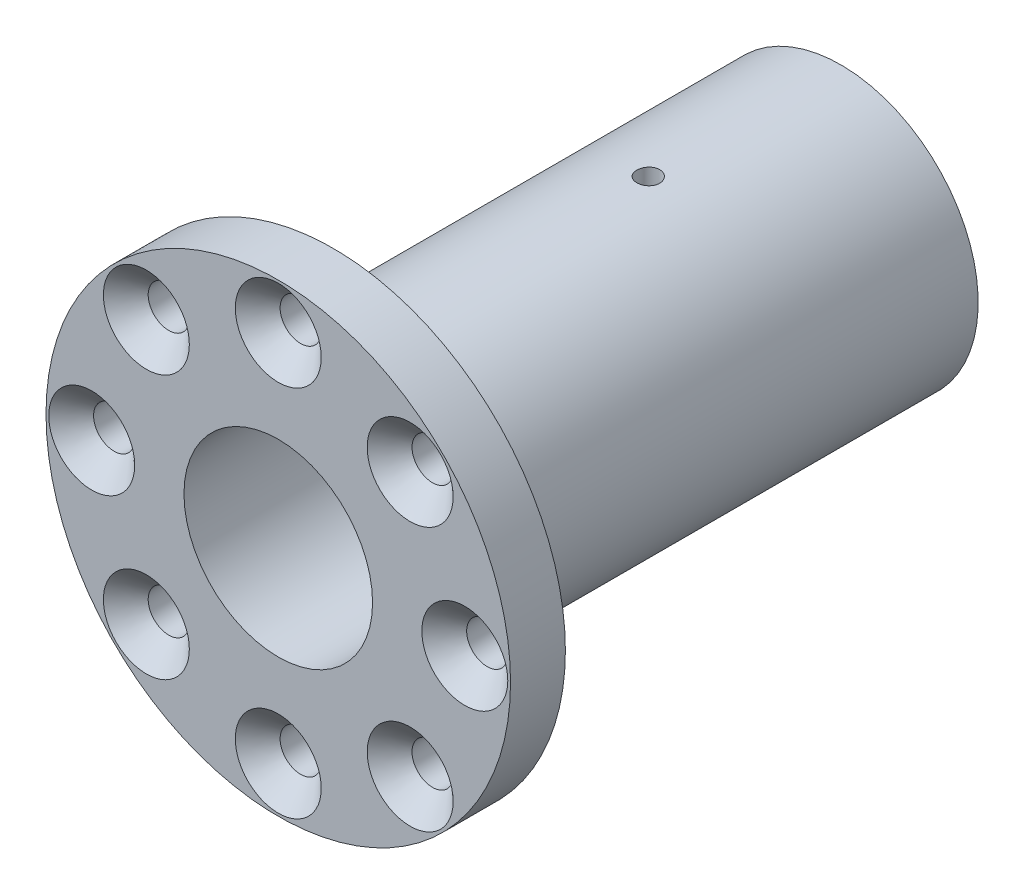
ISO-10303-21;
HEADER;
FILE_DESCRIPTION(('STEP AP214'),'2;1');
FILE_NAME('part.step','',(''),(''),'','','');
FILE_SCHEMA(('AUTOMOTIVE_DESIGN { 1 0 10303 214 1 1 1 1 }'));
ENDSEC;
DATA;
#1=APPLICATION_CONTEXT('core data for automotive mechanical design processes');
#2=APPLICATION_PROTOCOL_DEFINITION('international standard','automotive_design',2000,#1);
#3=PRODUCT_CONTEXT('',#1,'mechanical');
#4=PRODUCT('Part','Part','',(#3));
#5=PRODUCT_RELATED_PRODUCT_CATEGORY('part','',(#4));
#6=PRODUCT_DEFINITION_FORMATION('','',#4);
#7=PRODUCT_DEFINITION_CONTEXT('part definition',#1,'design');
#8=PRODUCT_DEFINITION('design','',#6,#7);
#9=PRODUCT_DEFINITION_SHAPE('','',#8);
#10=(LENGTH_UNIT() NAMED_UNIT(*) SI_UNIT(.MILLI.,.METRE.));
#11=(NAMED_UNIT(*) PLANE_ANGLE_UNIT() SI_UNIT($,.RADIAN.));
#12=(NAMED_UNIT(*) SI_UNIT($,.STERADIAN.) SOLID_ANGLE_UNIT());
#13=UNCERTAINTY_MEASURE_WITH_UNIT(LENGTH_MEASURE(1.E-05),#10,'distance_accuracy_value','');
#14=(GEOMETRIC_REPRESENTATION_CONTEXT(3) GLOBAL_UNCERTAINTY_ASSIGNED_CONTEXT((#13)) GLOBAL_UNIT_ASSIGNED_CONTEXT((#10,
#11,#12)) REPRESENTATION_CONTEXT('',''));
#15=CARTESIAN_POINT('',(0.,0.,0.));
#16=DIRECTION('',(0.,0.,1.));
#17=DIRECTION('',(1.,0.,0.));
#18=AXIS2_PLACEMENT_3D('',#15,#16,#17);
#19=CARTESIAN_POINT('',(-2.5,6.53834841531101,61.54));
#20=DIRECTION('',(-1.,0.,0.));
#21=DIRECTION('',(0.,0.,1.));
#22=AXIS2_PLACEMENT_3D('',#19,#20,#21);
#23=PLANE('',#22);
#24=DIRECTION('',(0.,1.,0.));
#25=VECTOR('',#24,1.);
#26=CARTESIAN_POINT('',(-2.5,6.53834841531101,23.44));
#27=LINE('',#26,#25);
#28=CARTESIAN_POINT('',(-2.5,6.54948151841044,23.44));
#29=VERTEX_POINT('',#28);
#30=CARTESIAN_POINT('',(-2.5,9.05849989544415,23.44));
#31=VERTEX_POINT('',#30);
#32=EDGE_CURVE('E73',#29,#31,#27,.T.);
#33=ORIENTED_EDGE('',*,*,#32,.F.);
#34=DIRECTION('',(0.,0.,-1.));
#35=VECTOR('',#34,1.);
#36=CARTESIAN_POINT('',(-2.5,6.54948151841044,61.54));
#37=LINE('',#36,#35);
#38=CARTESIAN_POINT('',(-2.5,6.54948151841044,0.));
#39=VERTEX_POINT('',#38);
#40=EDGE_CURVE('E78',#29,#39,#37,.T.);
#41=ORIENTED_EDGE('',*,*,#40,.T.);
#42=DIRECTION('',(0.,1.,0.));
#43=VECTOR('',#42,1.);
#44=CARTESIAN_POINT('',(-2.5,6.53834841531101,0.));
#45=LINE('',#44,#43);
#46=CARTESIAN_POINT('',(-2.5,9.05849989544415,0.));
#47=VERTEX_POINT('',#46);
#48=EDGE_CURVE('E86',#39,#47,#45,.T.);
#49=ORIENTED_EDGE('',*,*,#48,.T.);
#50=DIRECTION('',(0.,0.,-1.));
#51=VECTOR('',#50,1.);
#52=CARTESIAN_POINT('',(-2.5,9.05849989544415,61.54));
#53=LINE('',#52,#51);
#54=EDGE_CURVE('E54',#31,#47,#53,.T.);
#55=ORIENTED_EDGE('',*,*,#54,.F.);
#56=EDGE_LOOP('',(#33,#41,#49,#55));
#57=FACE_BOUND('',#56,.T.);
#58=ADVANCED_FACE('F32',(#57),#23,.F.);
#59=CARTESIAN_POINT('',(2.5,9.05849989544415,61.54));
#60=DIRECTION('',(1.,0.,0.));
#61=DIRECTION('',(0.,1.,0.));
#62=AXIS2_PLACEMENT_3D('',#59,#60,#61);
#63=PLANE('',#62);
#64=DIRECTION('',(0.,-1.,0.));
#65=VECTOR('',#64,1.);
#66=CARTESIAN_POINT('',(2.5,9.05849989544415,23.44));
#67=LINE('',#66,#65);
#68=CARTESIAN_POINT('',(2.5,9.05849989544415,23.44));
#69=VERTEX_POINT('',#68);
#70=CARTESIAN_POINT('',(2.5,6.54948151841044,23.44));
#71=VERTEX_POINT('',#70);
#72=EDGE_CURVE('E46',#69,#71,#67,.T.);
#73=ORIENTED_EDGE('',*,*,#72,.F.);
#74=DIRECTION('',(0.,0.,-1.));
#75=VECTOR('',#74,1.);
#76=CARTESIAN_POINT('',(2.5,9.05849989544415,61.54));
#77=LINE('',#76,#75);
#78=CARTESIAN_POINT('',(2.5,9.05849989544415,0.));
#79=VERTEX_POINT('',#78);
#80=EDGE_CURVE('E98',#69,#79,#77,.T.);
#81=ORIENTED_EDGE('',*,*,#80,.T.);
#82=DIRECTION('',(0.,-1.,0.));
#83=VECTOR('',#82,1.);
#84=CARTESIAN_POINT('',(2.5,9.05849989544415,0.));
#85=LINE('',#84,#83);
#86=CARTESIAN_POINT('',(2.5,6.54948151841044,0.));
#87=VERTEX_POINT('',#86);
#88=EDGE_CURVE('E95',#79,#87,#85,.T.);
#89=ORIENTED_EDGE('',*,*,#88,.T.);
#90=DIRECTION('',(0.,0.,-1.));
#91=VECTOR('',#90,1.);
#92=CARTESIAN_POINT('',(2.5,6.54948151841044,61.54));
#93=LINE('',#92,#91);
#94=EDGE_CURVE('E40',#87,#71,#93,.F.);
#95=ORIENTED_EDGE('',*,*,#94,.T.);
#96=EDGE_LOOP('',(#73,#81,#89,#95));
#97=FACE_BOUND('',#96,.T.);
#98=ADVANCED_FACE('F190',(#97),#63,.F.);
#99=CARTESIAN_POINT('',(-2.5,9.05849989544415,61.54));
#100=DIRECTION('',(0.,1.,0.));
#101=DIRECTION('',(0.,0.,1.));
#102=AXIS2_PLACEMENT_3D('',#99,#100,#101);
#103=PLANE('',#102);
#104=CARTESIAN_POINT('',(0.,9.05849989544415,21.082));
#105=DIRECTION('',(0.,-1.,0.));
#106=DIRECTION('',(0.,0.,-1.));
#107=AXIS2_PLACEMENT_3D('',#104,#105,#106);
#108=CIRCLE('',#107,1.24999999999999);
#109=CARTESIAN_POINT('',(0.,9.05849989544415,19.832));
#110=VERTEX_POINT('',#109);
#111=EDGE_CURVE('E123',#110,#110,#108,.T.);
#112=ORIENTED_EDGE('',*,*,#111,.F.);
#113=EDGE_LOOP('',(#112));
#114=FACE_BOUND('',#113,.T.);
#115=DIRECTION('',(1.,0.,0.));
#116=VECTOR('',#115,1.);
#117=CARTESIAN_POINT('',(-2.5,9.05849989544415,23.44));
#118=LINE('',#117,#116);
#119=EDGE_CURVE('E80',#31,#69,#118,.T.);
#120=ORIENTED_EDGE('',*,*,#119,.F.);
#121=ORIENTED_EDGE('',*,*,#54,.T.);
#122=DIRECTION('',(1.,0.,0.));
#123=VECTOR('',#122,1.);
#124=CARTESIAN_POINT('',(-2.5,9.05849989544415,0.));
#125=LINE('',#124,#123);
#126=EDGE_CURVE('E88',#47,#79,#125,.T.);
#127=ORIENTED_EDGE('',*,*,#126,.T.);
#128=ORIENTED_EDGE('',*,*,#80,.F.);
#129=EDGE_LOOP('',(#120,#121,#127,#128));
#130=FACE_BOUND('',#129,.T.);
#131=ADVANCED_FACE('F189',(#114,#130),#103,.F.);
#132=CARTESIAN_POINT('',(0.,0.,61.54));
#133=DIRECTION('',(0.,0.,-1.));
#134=DIRECTION('',(-1.,0.,0.));
#135=AXIS2_PLACEMENT_3D('',#132,#133,#134);
#136=CYLINDRICAL_SURFACE('',#135,7.01039999999999);
#137=CARTESIAN_POINT('',(0.,0.,23.44));
#138=DIRECTION('',(0.,0.,1.));
#139=DIRECTION('',(1.,0.,0.));
#140=AXIS2_PLACEMENT_3D('',#137,#138,#139);
#141=CIRCLE('',#140,7.01039999999999);
#142=EDGE_CURVE('E11',#71,#29,#141,.F.);
#143=ORIENTED_EDGE('',*,*,#142,.F.);
#144=ORIENTED_EDGE('',*,*,#94,.F.);
#145=CARTESIAN_POINT('',(0.,0.,0.));
#146=DIRECTION('',(0.,0.,-1.));
#147=DIRECTION('',(-1.,0.,0.));
#148=AXIS2_PLACEMENT_3D('',#145,#146,#147);
#149=CIRCLE('',#148,7.01039999999999);
#150=EDGE_CURVE('E84',#87,#39,#149,.T.);
#151=ORIENTED_EDGE('',*,*,#150,.T.);
#152=ORIENTED_EDGE('',*,*,#40,.F.);
#153=EDGE_LOOP('',(#143,#144,#151,#152));
#154=FACE_BOUND('',#153,.T.);
#155=ADVANCED_FACE('F82',(#154),#136,.F.);
#156=CARTESIAN_POINT('',(0.,0.,61.54));
#157=DIRECTION('',(0.,0.,-1.));
#158=DIRECTION('',(-1.,0.,0.));
#159=AXIS2_PLACEMENT_3D('',#156,#157,#158);
#160=CYLINDRICAL_SURFACE('',#159,25.4);
#161=CARTESIAN_POINT('',(0.,0.,61.54));
#162=DIRECTION('',(0.,0.,-1.));
#163=DIRECTION('',(-1.,0.,0.));
#164=AXIS2_PLACEMENT_3D('',#161,#162,#163);
#165=CIRCLE('',#164,25.4);
#166=CARTESIAN_POINT('',(-25.4,0.,61.54));
#167=VERTEX_POINT('',#166);
#168=EDGE_CURVE('E110',#167,#167,#165,.T.);
#169=ORIENTED_EDGE('',*,*,#168,.T.);
#170=EDGE_LOOP('',(#169));
#171=FACE_BOUND('',#170,.T.);
#172=CARTESIAN_POINT('',(0.,0.,55.54));
#173=DIRECTION('',(0.,0.,-1.));
#174=DIRECTION('',(-1.,0.,0.));
#175=AXIS2_PLACEMENT_3D('',#172,#173,#174);
#176=CIRCLE('',#175,25.4);
#177=CARTESIAN_POINT('',(-25.4,0.,55.54));
#178=VERTEX_POINT('',#177);
#179=EDGE_CURVE('E105',#178,#178,#176,.T.);
#180=ORIENTED_EDGE('',*,*,#179,.F.);
#181=EDGE_LOOP('',(#180));
#182=FACE_BOUND('',#181,.T.);
#183=ADVANCED_FACE('F34',(#171,#182),#160,.T.);
#184=CARTESIAN_POINT('',(25.4,0.,61.54));
#185=DIRECTION('',(0.,0.,1.));
#186=DIRECTION('',(1.,0.,0.));
#187=AXIS2_PLACEMENT_3D('',#184,#185,#186);
#188=PLANE('',#187);
#189=CARTESIAN_POINT('',(0.,0.,61.54));
#190=DIRECTION('',(0.,0.,1.));
#191=DIRECTION('',(1.,0.,0.));
#192=AXIS2_PLACEMENT_3D('',#189,#190,#191);
#193=CIRCLE('',#192,10.3124);
#194=CARTESIAN_POINT('',(10.3124,0.,61.54));
#195=VERTEX_POINT('',#194);
#196=EDGE_CURVE('E254',#195,#195,#193,.T.);
#197=ORIENTED_EDGE('',*,*,#196,.F.);
#198=EDGE_LOOP('',(#197));
#199=FACE_BOUND('',#198,.T.);
#200=CARTESIAN_POINT('',(0.,20.4,61.54));
#201=DIRECTION('',(0.,0.,1.));
#202=DIRECTION('',(1.,0.,0.));
#203=AXIS2_PLACEMENT_3D('',#200,#201,#202);
#204=CIRCLE('',#203,4.70000000001392);
#205=CARTESIAN_POINT('',(4.70000000001392,20.4,61.54));
#206=VERTEX_POINT('',#205);
#207=EDGE_CURVE('E258',#206,#206,#204,.T.);
#208=ORIENTED_EDGE('',*,*,#207,.F.);
#209=EDGE_LOOP('',(#208));
#210=FACE_BOUND('',#209,.T.);
#211=CARTESIAN_POINT('',(14.4249783362061,14.4249783362068,61.54));
#212=DIRECTION('',(0.,0.,1.));
#213=DIRECTION('',(1.,0.,0.));
#214=AXIS2_PLACEMENT_3D('',#211,#212,#213);
#215=CIRCLE('',#214,4.70000000001391);
#216=CARTESIAN_POINT('',(19.12497833622,14.4249783362068,61.54));
#217=VERTEX_POINT('',#216);
#218=EDGE_CURVE('E262',#217,#217,#215,.T.);
#219=ORIENTED_EDGE('',*,*,#218,.F.);
#220=EDGE_LOOP('',(#219));
#221=FACE_BOUND('',#220,.T.);
#222=CARTESIAN_POINT('',(20.4000000000017,1.73691033767046E-12,61.54));
#223=DIRECTION('',(0.,0.,1.));
#224=DIRECTION('',(1.,0.,0.));
#225=AXIS2_PLACEMENT_3D('',#222,#223,#224);
#226=CIRCLE('',#225,4.70000000001392);
#227=CARTESIAN_POINT('',(25.1000000000156,1.73691033767046E-12,61.54));
#228=VERTEX_POINT('',#227);
#229=EDGE_CURVE('E266',#228,#228,#226,.T.);
#230=ORIENTED_EDGE('',*,*,#229,.F.);
#231=EDGE_LOOP('',(#230));
#232=FACE_BOUND('',#231,.T.);
#233=CARTESIAN_POINT('',(14.4249783362085,-14.4249783362043,61.54));
#234=DIRECTION('',(0.,0.,1.));
#235=DIRECTION('',(1.,0.,0.));
#236=AXIS2_PLACEMENT_3D('',#233,#234,#235);
#237=CIRCLE('',#236,4.70000000001392);
#238=CARTESIAN_POINT('',(19.1249783362224,-14.4249783362043,61.54));
#239=VERTEX_POINT('',#238);
#240=EDGE_CURVE('E270',#239,#239,#237,.T.);
#241=ORIENTED_EDGE('',*,*,#240,.F.);
#242=EDGE_LOOP('',(#241));
#243=FACE_BOUND('',#242,.T.);
#244=CARTESIAN_POINT('',(3.47378376064356E-12,-20.4,61.54));
#245=DIRECTION('',(0.,0.,1.));
#246=DIRECTION('',(1.,0.,0.));
#247=AXIS2_PLACEMENT_3D('',#244,#245,#246);
#248=CIRCLE('',#247,4.70000000001392);
#249=CARTESIAN_POINT('',(4.70000000001739,-20.4,61.54));
#250=VERTEX_POINT('',#249);
#251=EDGE_CURVE('E274',#250,#250,#248,.T.);
#252=ORIENTED_EDGE('',*,*,#251,.F.);
#253=EDGE_LOOP('',(#252));
#254=FACE_BOUND('',#253,.T.);
#255=CARTESIAN_POINT('',(-14.4249783362026,-14.4249783362068,61.54));
#256=DIRECTION('',(0.,0.,1.));
#257=DIRECTION('',(1.,0.,0.));
#258=AXIS2_PLACEMENT_3D('',#255,#256,#257);
#259=CIRCLE('',#258,4.70000000001392);
#260=CARTESIAN_POINT('',(-9.72497833618869,-14.4249783362068,61.54));
#261=VERTEX_POINT('',#260);
#262=EDGE_CURVE('E278',#261,#261,#259,.T.);
#263=ORIENTED_EDGE('',*,*,#262,.F.);
#264=EDGE_LOOP('',(#263));
#265=FACE_BOUND('',#264,.T.);
#266=CARTESIAN_POINT('',(-20.3999999999983,-1.73940861714072E-12,61.54));
#267=DIRECTION('',(0.,0.,1.));
#268=DIRECTION('',(1.,0.,0.));
#269=AXIS2_PLACEMENT_3D('',#266,#267,#268);
#270=CIRCLE('',#269,4.70000000001392);
#271=CARTESIAN_POINT('',(-15.6999999999844,-1.73940861714072E-12,61.54));
#272=VERTEX_POINT('',#271);
#273=EDGE_CURVE('E282',#272,#272,#270,.T.);
#274=ORIENTED_EDGE('',*,*,#273,.F.);
#275=EDGE_LOOP('',(#274));
#276=FACE_BOUND('',#275,.T.);
#277=CARTESIAN_POINT('',(-14.4249783362051,14.4249783362043,61.54));
#278=DIRECTION('',(0.,0.,1.));
#279=DIRECTION('',(1.,0.,0.));
#280=AXIS2_PLACEMENT_3D('',#277,#278,#279);
#281=CIRCLE('',#280,4.70000000001392);
#282=CARTESIAN_POINT('',(-9.72497833619114,14.4249783362043,61.54));
#283=VERTEX_POINT('',#282);
#284=EDGE_CURVE('E285',#283,#283,#281,.T.);
#285=ORIENTED_EDGE('',*,*,#284,.F.);
#286=EDGE_LOOP('',(#285));
#287=FACE_BOUND('',#286,.T.);
#288=ORIENTED_EDGE('',*,*,#168,.F.);
#289=EDGE_LOOP('',(#288));
#290=FACE_BOUND('',#289,.T.);
#291=ADVANCED_FACE('F237',(#199,#210,#221,#232,#243,#254,#265,#276,#287,#290),#188,.T.);
#292=CARTESIAN_POINT('',(0.,0.,55.54));
#293=DIRECTION('',(0.,0.,-1.));
#294=DIRECTION('',(-1.,0.,0.));
#295=AXIS2_PLACEMENT_3D('',#292,#293,#294);
#296=PLANE('',#295);
#297=CARTESIAN_POINT('',(0.,20.4,55.54));
#298=DIRECTION('',(0.,0.,-1.));
#299=DIRECTION('',(-1.,0.,0.));
#300=AXIS2_PLACEMENT_3D('',#297,#298,#299);
#301=CIRCLE('',#300,2.24999999999998);
#302=CARTESIAN_POINT('',(-2.24999999999998,20.4,55.54));
#303=VERTEX_POINT('',#302);
#304=EDGE_CURVE('E422',#303,#303,#301,.T.);
#305=ORIENTED_EDGE('',*,*,#304,.F.);
#306=EDGE_LOOP('',(#305));
#307=FACE_BOUND('',#306,.T.);
#308=CARTESIAN_POINT('',(14.4249783362061,14.4249783362068,55.54));
#309=DIRECTION('',(0.,0.,-1.));
#310=DIRECTION('',(-1.,0.,0.));
#311=AXIS2_PLACEMENT_3D('',#308,#309,#310);
#312=CIRCLE('',#311,2.24999999999998);
#313=CARTESIAN_POINT('',(12.1749783362061,14.4249783362068,55.54));
#314=VERTEX_POINT('',#313);
#315=EDGE_CURVE('E427',#314,#314,#312,.T.);
#316=ORIENTED_EDGE('',*,*,#315,.F.);
#317=EDGE_LOOP('',(#316));
#318=FACE_BOUND('',#317,.T.);
#319=CARTESIAN_POINT('',(20.4000000000017,1.73691033767046E-12,55.54));
#320=DIRECTION('',(0.,0.,-1.));
#321=DIRECTION('',(-1.,0.,0.));
#322=AXIS2_PLACEMENT_3D('',#319,#320,#321);
#323=CIRCLE('',#322,2.24999999999998);
#324=CARTESIAN_POINT('',(18.1500000000018,1.73691033767046E-12,55.54));
#325=VERTEX_POINT('',#324);
#326=EDGE_CURVE('E432',#325,#325,#323,.T.);
#327=ORIENTED_EDGE('',*,*,#326,.F.);
#328=EDGE_LOOP('',(#327));
#329=FACE_BOUND('',#328,.T.);
#330=CARTESIAN_POINT('',(14.4249783362085,-14.4249783362043,55.54));
#331=DIRECTION('',(0.,0.,-1.));
#332=DIRECTION('',(-1.,0.,0.));
#333=AXIS2_PLACEMENT_3D('',#330,#331,#332);
#334=CIRCLE('',#333,2.24999999999998);
#335=CARTESIAN_POINT('',(12.1749783362086,-14.4249783362043,55.54));
#336=VERTEX_POINT('',#335);
#337=EDGE_CURVE('E437',#336,#336,#334,.T.);
#338=ORIENTED_EDGE('',*,*,#337,.F.);
#339=EDGE_LOOP('',(#338));
#340=FACE_BOUND('',#339,.T.);
#341=CARTESIAN_POINT('',(3.47378376064356E-12,-20.4,55.54));
#342=DIRECTION('',(0.,0.,-1.));
#343=DIRECTION('',(-1.,0.,0.));
#344=AXIS2_PLACEMENT_3D('',#341,#342,#343);
#345=CIRCLE('',#344,2.24999999999998);
#346=CARTESIAN_POINT('',(-2.2499999999965,-20.4,55.54));
#347=VERTEX_POINT('',#346);
#348=EDGE_CURVE('E442',#347,#347,#345,.T.);
#349=ORIENTED_EDGE('',*,*,#348,.F.);
#350=EDGE_LOOP('',(#349));
#351=FACE_BOUND('',#350,.T.);
#352=CARTESIAN_POINT('',(-14.4249783362026,-14.4249783362068,55.54));
#353=DIRECTION('',(0.,0.,-1.));
#354=DIRECTION('',(-1.,0.,0.));
#355=AXIS2_PLACEMENT_3D('',#352,#353,#354);
#356=CIRCLE('',#355,2.24999999999998);
#357=CARTESIAN_POINT('',(-16.6749783362026,-14.4249783362068,55.54));
#358=VERTEX_POINT('',#357);
#359=EDGE_CURVE('E446',#358,#358,#356,.T.);
#360=ORIENTED_EDGE('',*,*,#359,.F.);
#361=EDGE_LOOP('',(#360));
#362=FACE_BOUND('',#361,.T.);
#363=CARTESIAN_POINT('',(-20.3999999999983,-1.73940861714072E-12,55.54));
#364=DIRECTION('',(0.,0.,-1.));
#365=DIRECTION('',(-1.,0.,0.));
#366=AXIS2_PLACEMENT_3D('',#363,#364,#365);
#367=CIRCLE('',#366,2.24999999999998);
#368=CARTESIAN_POINT('',(-22.6499999999982,-1.73940861714072E-12,55.54));
#369=VERTEX_POINT('',#368);
#370=EDGE_CURVE('E288',#369,#369,#367,.T.);
#371=ORIENTED_EDGE('',*,*,#370,.F.);
#372=EDGE_LOOP('',(#371));
#373=FACE_BOUND('',#372,.T.);
#374=CARTESIAN_POINT('',(-14.4249783362051,14.4249783362043,55.54));
#375=DIRECTION('',(0.,0.,-1.));
#376=DIRECTION('',(-1.,0.,0.));
#377=AXIS2_PLACEMENT_3D('',#374,#375,#376);
#378=CIRCLE('',#377,2.24999999999998);
#379=CARTESIAN_POINT('',(-16.674978336205,14.4249783362043,55.54));
#380=VERTEX_POINT('',#379);
#381=EDGE_CURVE('E124',#380,#380,#378,.T.);
#382=ORIENTED_EDGE('',*,*,#381,.F.);
#383=EDGE_LOOP('',(#382));
#384=FACE_BOUND('',#383,.T.);
#385=CARTESIAN_POINT('',(0.,0.,55.54));
#386=DIRECTION('',(0.,0.,-1.));
#387=DIRECTION('',(-1.,0.,0.));
#388=AXIS2_PLACEMENT_3D('',#385,#386,#387);
#389=CIRCLE('',#388,15.);
#390=CARTESIAN_POINT('',(-15.,0.,55.54));
#391=VERTEX_POINT('',#390);
#392=EDGE_CURVE('E100',#391,#391,#389,.T.);
#393=ORIENTED_EDGE('',*,*,#392,.F.);
#394=EDGE_LOOP('',(#393));
#395=FACE_BOUND('',#394,.T.);
#396=ORIENTED_EDGE('',*,*,#179,.T.);
#397=EDGE_LOOP('',(#396));
#398=FACE_BOUND('',#397,.T.);
#399=ADVANCED_FACE('F203',(#307,#318,#329,#340,#351,#362,#373,#384,#395,#398),#296,.T.);
#400=CARTESIAN_POINT('',(0.,0.,0.));
#401=DIRECTION('',(0.,0.,1.));
#402=DIRECTION('',(1.,0.,0.));
#403=AXIS2_PLACEMENT_3D('',#400,#401,#402);
#404=CYLINDRICAL_SURFACE('',#403,15.);
#405=CARTESIAN_POINT('',(0.,15.,19.832));
#406=CARTESIAN_POINT('',(0.0700826124015046,14.999999317644,19.8320030610329));
#407=CARTESIAN_POINT('',(0.140212933975281,14.9995036067925,19.8379137122638));
#408=CARTESIAN_POINT('',(0.278533213375484,14.9975737791031,19.8614054398189));
#409=CARTESIAN_POINT('',(0.346720881531534,14.9961385991462,19.8789997378811));
#410=CARTESIAN_POINT('',(0.479132528142821,14.9924920155763,19.9253464422617));
#411=CARTESIAN_POINT('',(0.543358725530763,14.9902810512311,19.9540925351373));
#412=CARTESIAN_POINT('',(0.666059041770088,14.9853308468089,20.02191553984));
#413=CARTESIAN_POINT('',(0.724534387356729,14.982591719767,20.0609902418469));
#414=CARTESIAN_POINT('',(0.83423749995698,14.9768847483339,20.1484688332575));
#415=CARTESIAN_POINT('',(0.885448590520192,14.9739164010822,20.1968936049196));
#416=CARTESIAN_POINT('',(0.979026416920682,14.9680897600396,20.3016536198124));
#417=CARTESIAN_POINT('',(1.02139276421437,14.965231471088,20.3579892103783));
#418=CARTESIAN_POINT('',(1.09613490298778,14.9599431582655,20.4770726463738));
#419=CARTESIAN_POINT('',(1.12849604118942,14.9575137647512,20.5398297192535));
#420=CARTESIAN_POINT('',(1.18221554221729,14.9533640556034,20.669910369445));
#421=CARTESIAN_POINT('',(1.20357409939051,14.9516437274454,20.7372338660728));
#422=CARTESIAN_POINT('',(1.2346337872732,14.949111150829,20.8743692398515));
#423=CARTESIAN_POINT('',(1.24436208173721,14.9482967867028,20.9441749249908));
#424=CARTESIAN_POINT('',(1.25196901001927,14.9476616540185,21.0844327549317));
#425=CARTESIAN_POINT('',(1.24984786622441,14.9478408668133,21.1548848875763));
#426=CARTESIAN_POINT('',(1.23383858026855,14.9491707170205,21.2942495818882));
#427=CARTESIAN_POINT('',(1.21997996004756,14.9503189172232,21.3631655613455));
#428=CARTESIAN_POINT('',(1.18093498172866,14.9534535446171,21.4976898342412));
#429=CARTESIAN_POINT('',(1.15574851299597,14.955439979995,21.5632980953673));
#430=CARTESIAN_POINT('',(1.09472973519003,14.9600300588357,21.6894386323476));
#431=CARTESIAN_POINT('',(1.05888418094648,14.9626344693871,21.7499644719844));
#432=CARTESIAN_POINT('',(0.977574304891675,14.9681663357985,21.8641516735248));
#433=CARTESIAN_POINT('',(0.932109788278167,14.9710937982004,21.9178128963715));
#434=CARTESIAN_POINT('',(0.832686977782944,14.9769527551456,22.0169192741019));
#435=CARTESIAN_POINT('',(0.77870316173821,14.9798842346883,22.0623388301616));
#436=CARTESIAN_POINT('',(0.663863195464681,14.9854123983729,22.1434746542357));
#437=CARTESIAN_POINT('',(0.603007040644165,14.9880090822911,22.1791909157669));
#438=CARTESIAN_POINT('',(0.476133241584809,14.9925755726205,22.2399047033359));
#439=CARTESIAN_POINT('',(0.410115052261338,14.9945453127181,22.2649010955977));
#440=CARTESIAN_POINT('',(0.274798836274474,14.9976352176475,22.3034476655641));
#441=CARTESIAN_POINT('',(0.205500877711066,14.9987554001111,22.3169980808191));
#442=CARTESIAN_POINT('',(0.0658141252053123,15.0000177117881,22.332235955052));
#443=CARTESIAN_POINT('',(-0.0045707863939955,15.00016275615,22.3339587726336));
#444=CARTESIAN_POINT('',(-0.144628440629128,14.9994662347338,22.3255851742158));
#445=CARTESIAN_POINT('',(-0.214301189901765,14.9986246781584,22.3154888684632));
#446=CARTESIAN_POINT('',(-0.350855945280871,14.9960514730165,22.2837929267374));
#447=CARTESIAN_POINT('',(-0.417741781424648,14.9943210927178,22.2622096799677));
#448=CARTESIAN_POINT('',(-0.546942706353105,14.9901646264044,22.2081692652724));
#449=CARTESIAN_POINT('',(-0.609257722853909,14.9877385293905,22.1757119254269));
#450=CARTESIAN_POINT('',(-0.727709022877376,14.9824553299204,22.1007558134795));
#451=CARTESIAN_POINT('',(-0.783830438151828,14.9795972277342,22.0582336170065));
#452=CARTESIAN_POINT('',(-0.888151368554517,14.9737744829962,21.9643886786869));
#453=CARTESIAN_POINT('',(-0.93635074601797,14.9708098385941,21.9130657839384));
#454=CARTESIAN_POINT('',(-1.02358068181887,14.9650995151978,21.8029228847521));
#455=CARTESIAN_POINT('',(-1.06258816654204,14.9623543984278,21.7440845735032));
#456=CARTESIAN_POINT('',(-1.13016882854939,14.957401896804,21.6206721714207));
#457=CARTESIAN_POINT('',(-1.15874211001244,14.9551945065815,21.5560981378626));
#458=CARTESIAN_POINT('',(-1.20460397180069,14.9515705356118,21.4231290118259));
#459=CARTESIAN_POINT('',(-1.2219066768116,14.9501529653579,21.3547388191071));
#460=CARTESIAN_POINT('',(-1.24478221238768,14.9482658211357,21.216011625157));
#461=CARTESIAN_POINT('',(-1.25035526821032,14.9477962289621,21.145674661338));
#462=CARTESIAN_POINT('',(-1.24961070361365,14.9478584743774,21.0052798424739));
#463=CARTESIAN_POINT('',(-1.24332933722173,14.9483872586634,20.9352217909545));
#464=CARTESIAN_POINT('',(-1.21912982911878,14.9503801885288,20.7971593330614));
#465=CARTESIAN_POINT('',(-1.20121166965952,14.951844335535,20.7291549298202));
#466=CARTESIAN_POINT('',(-1.15425638752132,14.9555422141463,20.5971277959167));
#467=CARTESIAN_POINT('',(-1.12521991750816,14.9577759005774,20.5331048317929));
#468=CARTESIAN_POINT('',(-1.05685632368405,14.9627612484384,20.4108364492829));
#469=CARTESIAN_POINT('',(-1.01752936139319,14.9655129017381,20.3525909402333));
#470=CARTESIAN_POINT('',(-0.929564927653049,14.9712341462335,20.2433453262337));
#471=CARTESIAN_POINT('',(-0.880900617176813,14.9742043500718,20.1923668641783));
#472=CARTESIAN_POINT('',(-0.775691531990572,14.980022437621,20.0992810184959));
#473=CARTESIAN_POINT('',(-0.719144853301355,14.9828702915603,20.05717578438));
#474=CARTESIAN_POINT('',(-0.59966721628676,14.9881279355284,19.9829751744781));
#475=CARTESIAN_POINT('',(-0.536724570338166,14.9905369002888,19.9508985766796));
#476=CARTESIAN_POINT('',(-0.406369689994662,14.9946356564538,19.8978102461859));
#477=CARTESIAN_POINT('',(-0.33896269426706,14.9963262741032,19.8767857946399));
#478=CARTESIAN_POINT('',(-0.225965060120847,14.9983638466732,19.8517530218725));
#479=CARTESIAN_POINT('',(-0.181101118048087,14.9989746109619,19.8443554843532));
#480=CARTESIAN_POINT('',(-0.0908314643764523,14.9997929082329,19.8344779879035));
#481=CARTESIAN_POINT('',(-0.0454257542163059,15.0000004422857,19.8319980159169));
#482=CARTESIAN_POINT('',(0.,15.,19.832));
#483=B_SPLINE_CURVE_WITH_KNOTS('',3,(#405,#406,#407,#408,#409,#410,#411,#412,#413,#414,#415,
#416,#417,#418,#419,#420,#421,#422,#423,#424,#425,#426,#427,#428,#429,#430,#431,#432,#433,#434,
#435,#436,#437,#438,#439,#440,#441,#442,#443,#444,#445,#446,#447,#448,#449,#450,#451,#452,#453,
#454,#455,#456,#457,#458,#459,#460,#461,#462,#463,#464,#465,#466,#467,#468,#469,#470,#471,#472,
#473,#474,#475,#476,#477,#478,#479,#480,#481,#482),.UNSPECIFIED.,.T.,.F.,(4,2,2,2,2,2,2,2,2,2,2,
2,2,2,2,2,2,2,2,2,2,2,2,2,2,2,2,2,2,2,2,2,2,2,2,2,2,2,4),(0.,0.210081983500172,0.42040211124729,
0.630603342361185,0.840759636980218,1.05139083598219,1.26203128592413,1.47297878688863,
1.68392256159874,1.89437268539481,2.10481885953272,2.3147372888786,2.52465776846246,
2.73484019686122,2.94502688226072,3.15585563668934,3.36668453198303,3.57753571988059,
3.78838253165665,3.99859874133957,4.20881299017772,4.41872811288477,4.62864655451711,
4.83905843718653,5.04947397589058,5.26041220613997,5.4713483302478,5.68201959051155,
5.89268680498441,6.10271078603153,6.31273508740418,6.52274706184397,6.73275574012314,
6.94337735830792,7.15404994040594,7.36511466328185,7.57593595739724,7.7121060794582,
7.84827583998425),.UNSPECIFIED.);
#484=CARTESIAN_POINT('',(0.,15.,19.832));
#485=VERTEX_POINT('',#484);
#486=EDGE_CURVE('E114',#485,#485,#483,.T.);
#487=ORIENTED_EDGE('',*,*,#486,.T.);
#488=EDGE_LOOP('',(#487));
#489=FACE_BOUND('',#488,.T.);
#490=CARTESIAN_POINT('',(0.,0.,0.));
#491=DIRECTION('',(0.,0.,-1.));
#492=DIRECTION('',(-1.,0.,0.));
#493=AXIS2_PLACEMENT_3D('',#490,#491,#492);
#494=CIRCLE('',#493,15.);
#495=CARTESIAN_POINT('',(-15.,0.,0.));
#496=VERTEX_POINT('',#495);
#497=EDGE_CURVE('E102',#496,#496,#494,.T.);
#498=ORIENTED_EDGE('',*,*,#497,.F.);
#499=EDGE_LOOP('',(#498));
#500=FACE_BOUND('',#499,.T.);
#501=ORIENTED_EDGE('',*,*,#392,.T.);
#502=EDGE_LOOP('',(#501));
#503=FACE_BOUND('',#502,.T.);
#504=ADVANCED_FACE('F126',(#489,#500,#503),#404,.T.);
#505=CARTESIAN_POINT('',(0.,0.,0.));
#506=DIRECTION('',(0.,0.,-1.));
#507=DIRECTION('',(-1.,0.,0.));
#508=AXIS2_PLACEMENT_3D('',#505,#506,#507);
#509=PLANE('',#508);
#510=CARTESIAN_POINT('',(11.4999999999991,-7.61616736356426E-13,0.));
#511=DIRECTION('',(0.,0.,-1.));
#512=DIRECTION('',(-1.,0.,0.));
#513=AXIS2_PLACEMENT_3D('',#510,#511,#512);
#514=CIRCLE('',#513,1.24999999999999);
#515=CARTESIAN_POINT('',(10.2499999999991,-7.61616736356426E-13,0.));
#516=VERTEX_POINT('',#515);
#517=EDGE_CURVE('E122',#516,#516,#514,.T.);
#518=ORIENTED_EDGE('',*,*,#517,.F.);
#519=EDGE_LOOP('',(#518));
#520=FACE_BOUND('',#519,.T.);
#521=CARTESIAN_POINT('',(5.74999999999794,-9.95929214352135,0.));
#522=DIRECTION('',(0.,0.,-1.));
#523=DIRECTION('',(-1.,0.,0.));
#524=AXIS2_PLACEMENT_3D('',#521,#522,#523);
#525=CIRCLE('',#524,1.24999999999999);
#526=CARTESIAN_POINT('',(4.49999999999795,-9.95929214352135,0.));
#527=VERTEX_POINT('',#526);
#528=EDGE_CURVE('E211',#527,#527,#525,.T.);
#529=ORIENTED_EDGE('',*,*,#528,.F.);
#530=EDGE_LOOP('',(#529));
#531=FACE_BOUND('',#530,.T.);
#532=CARTESIAN_POINT('',(-5.75000000000222,-9.95929214352015,0.));
#533=DIRECTION('',(0.,0.,-1.));
#534=DIRECTION('',(-1.,0.,0.));
#535=AXIS2_PLACEMENT_3D('',#532,#533,#534);
#536=CIRCLE('',#535,1.24999999999999);
#537=CARTESIAN_POINT('',(-7.00000000000221,-9.95929214352015,0.));
#538=VERTEX_POINT('',#537);
#539=EDGE_CURVE('E215',#538,#538,#536,.T.);
#540=ORIENTED_EDGE('',*,*,#539,.F.);
#541=EDGE_LOOP('',(#540));
#542=FACE_BOUND('',#541,.T.);
#543=CARTESIAN_POINT('',(-11.5000000000013,1.64225995095778E-12,0.));
#544=DIRECTION('',(0.,0.,-1.));
#545=DIRECTION('',(-1.,0.,0.));
#546=AXIS2_PLACEMENT_3D('',#543,#544,#545);
#547=CIRCLE('',#546,1.24999999999999);
#548=CARTESIAN_POINT('',(-12.7500000000013,1.64225995095778E-12,0.));
#549=VERTEX_POINT('',#548);
#550=EDGE_CURVE('E219',#549,#549,#547,.T.);
#551=ORIENTED_EDGE('',*,*,#550,.F.);
#552=EDGE_LOOP('',(#551));
#553=FACE_BOUND('',#552,.T.);
#554=CARTESIAN_POINT('',(-5.75000000000015,9.95929214352223,0.));
#555=DIRECTION('',(0.,0.,-1.));
#556=DIRECTION('',(-1.,0.,0.));
#557=AXIS2_PLACEMENT_3D('',#554,#555,#556);
#558=CIRCLE('',#557,1.24999999999999);
#559=CARTESIAN_POINT('',(-7.00000000000014,9.95929214352223,0.));
#560=VERTEX_POINT('',#559);
#561=EDGE_CURVE('E223',#560,#560,#558,.T.);
#562=ORIENTED_EDGE('',*,*,#561,.F.);
#563=EDGE_LOOP('',(#562));
#564=FACE_BOUND('',#563,.T.);
#565=CARTESIAN_POINT('',(5.75000000000002,9.95929214352104,0.));
#566=DIRECTION('',(0.,0.,-1.));
#567=DIRECTION('',(-1.,0.,0.));
#568=AXIS2_PLACEMENT_3D('',#565,#566,#567);
#569=CIRCLE('',#568,1.24999999999999);
#570=CARTESIAN_POINT('',(4.50000000000003,9.95929214352104,0.));
#571=VERTEX_POINT('',#570);
#572=EDGE_CURVE('E227',#571,#571,#569,.T.);
#573=ORIENTED_EDGE('',*,*,#572,.F.);
#574=EDGE_LOOP('',(#573));
#575=FACE_BOUND('',#574,.T.);
#576=ORIENTED_EDGE('',*,*,#150,.F.);
#577=ORIENTED_EDGE('',*,*,#88,.F.);
#578=ORIENTED_EDGE('',*,*,#126,.F.);
#579=ORIENTED_EDGE('',*,*,#48,.F.);
#580=EDGE_LOOP('',(#576,#577,#578,#579));
#581=FACE_BOUND('',#580,.T.);
#582=ORIENTED_EDGE('',*,*,#497,.T.);
#583=EDGE_LOOP('',(#582));
#584=FACE_BOUND('',#583,.T.);
#585=ADVANCED_FACE('F185',(#520,#531,#542,#553,#564,#575,#581,#584),#509,.T.);
#586=CARTESIAN_POINT('',(5.75000000000001,9.95929214352104,12.));
#587=DIRECTION('',(0.,0.,1.));
#588=DIRECTION('',(1.,0.,0.));
#589=AXIS2_PLACEMENT_3D('',#586,#587,#588);
#590=PLANE('',#589);
#591=CARTESIAN_POINT('',(5.75000000000002,9.95929214352104,12.));
#592=DIRECTION('',(0.,0.,-1.));
#593=DIRECTION('',(-1.,0.,0.));
#594=AXIS2_PLACEMENT_3D('',#591,#592,#593);
#595=CIRCLE('',#594,1.24999999999999);
#596=CARTESIAN_POINT('',(4.50000000000003,9.95929214352104,12.));
#597=VERTEX_POINT('',#596);
#598=EDGE_CURVE('E90',#597,#597,#595,.T.);
#599=ORIENTED_EDGE('',*,*,#598,.T.);
#600=EDGE_LOOP('',(#599));
#601=FACE_BOUND('',#600,.T.);
#602=ADVANCED_FACE('F181',(#601),#590,.F.);
#603=CARTESIAN_POINT('',(5.75000000000002,9.95929214352104,0.));
#604=DIRECTION('',(0.,0.,-1.));
#605=DIRECTION('',(-1.,0.,0.));
#606=AXIS2_PLACEMENT_3D('',#603,#604,#605);
#607=CYLINDRICAL_SURFACE('',#606,1.24999999999999);
#608=ORIENTED_EDGE('',*,*,#598,.F.);
#609=EDGE_LOOP('',(#608));
#610=FACE_BOUND('',#609,.T.);
#611=ORIENTED_EDGE('',*,*,#572,.T.);
#612=EDGE_LOOP('',(#611));
#613=FACE_BOUND('',#612,.T.);
#614=ADVANCED_FACE('F177',(#610,#613),#607,.F.);
#615=CARTESIAN_POINT('',(-5.75000000000015,9.95929214352223,12.));
#616=DIRECTION('',(0.,0.,1.));
#617=DIRECTION('',(1.,0.,0.));
#618=AXIS2_PLACEMENT_3D('',#615,#616,#617);
#619=PLANE('',#618);
#620=CARTESIAN_POINT('',(-5.75000000000015,9.95929214352223,12.));
#621=DIRECTION('',(0.,0.,-1.));
#622=DIRECTION('',(-1.,0.,0.));
#623=AXIS2_PLACEMENT_3D('',#620,#621,#622);
#624=CIRCLE('',#623,1.24999999999999);
#625=CARTESIAN_POINT('',(-7.00000000000014,9.95929214352223,12.));
#626=VERTEX_POINT('',#625);
#627=EDGE_CURVE('E316',#626,#626,#624,.T.);
#628=ORIENTED_EDGE('',*,*,#627,.T.);
#629=EDGE_LOOP('',(#628));
#630=FACE_BOUND('',#629,.T.);
#631=ADVANCED_FACE('F173',(#630),#619,.F.);
#632=CARTESIAN_POINT('',(-5.75000000000015,9.95929214352223,0.));
#633=DIRECTION('',(0.,0.,-1.));
#634=DIRECTION('',(-1.,0.,0.));
#635=AXIS2_PLACEMENT_3D('',#632,#633,#634);
#636=CYLINDRICAL_SURFACE('',#635,1.24999999999999);
#637=ORIENTED_EDGE('',*,*,#627,.F.);
#638=EDGE_LOOP('',(#637));
#639=FACE_BOUND('',#638,.T.);
#640=ORIENTED_EDGE('',*,*,#561,.T.);
#641=EDGE_LOOP('',(#640));
#642=FACE_BOUND('',#641,.T.);
#643=ADVANCED_FACE('F169',(#639,#642),#636,.F.);
#644=CARTESIAN_POINT('',(-11.5000000000013,1.64225995095778E-12,12.));
#645=DIRECTION('',(0.,0.,1.));
#646=DIRECTION('',(1.,0.,0.));
#647=AXIS2_PLACEMENT_3D('',#644,#645,#646);
#648=PLANE('',#647);
#649=CARTESIAN_POINT('',(-11.5000000000013,1.64225995095778E-12,12.));
#650=DIRECTION('',(0.,0.,-1.));
#651=DIRECTION('',(-1.,0.,0.));
#652=AXIS2_PLACEMENT_3D('',#649,#650,#651);
#653=CIRCLE('',#652,1.24999999999999);
#654=CARTESIAN_POINT('',(-12.7500000000013,1.64225995095778E-12,12.));
#655=VERTEX_POINT('',#654);
#656=EDGE_CURVE('E312',#655,#655,#653,.T.);
#657=ORIENTED_EDGE('',*,*,#656,.T.);
#658=EDGE_LOOP('',(#657));
#659=FACE_BOUND('',#658,.T.);
#660=ADVANCED_FACE('F165',(#659),#648,.F.);
#661=CARTESIAN_POINT('',(-11.5000000000013,1.64225995095778E-12,0.));
#662=DIRECTION('',(0.,0.,-1.));
#663=DIRECTION('',(-1.,0.,0.));
#664=AXIS2_PLACEMENT_3D('',#661,#662,#663);
#665=CYLINDRICAL_SURFACE('',#664,1.24999999999999);
#666=ORIENTED_EDGE('',*,*,#656,.F.);
#667=EDGE_LOOP('',(#666));
#668=FACE_BOUND('',#667,.T.);
#669=ORIENTED_EDGE('',*,*,#550,.T.);
#670=EDGE_LOOP('',(#669));
#671=FACE_BOUND('',#670,.T.);
#672=ADVANCED_FACE('F161',(#668,#671),#665,.F.);
#673=CARTESIAN_POINT('',(-5.75000000000223,-9.95929214352015,12.));
#674=DIRECTION('',(0.,0.,1.));
#675=DIRECTION('',(1.,0.,0.));
#676=AXIS2_PLACEMENT_3D('',#673,#674,#675);
#677=PLANE('',#676);
#678=CARTESIAN_POINT('',(-5.75000000000222,-9.95929214352015,12.));
#679=DIRECTION('',(0.,0.,-1.));
#680=DIRECTION('',(-1.,0.,0.));
#681=AXIS2_PLACEMENT_3D('',#678,#679,#680);
#682=CIRCLE('',#681,1.24999999999999);
#683=CARTESIAN_POINT('',(-7.00000000000221,-9.95929214352015,12.));
#684=VERTEX_POINT('',#683);
#685=EDGE_CURVE('E308',#684,#684,#682,.T.);
#686=ORIENTED_EDGE('',*,*,#685,.T.);
#687=EDGE_LOOP('',(#686));
#688=FACE_BOUND('',#687,.T.);
#689=ADVANCED_FACE('F157',(#688),#677,.F.);
#690=CARTESIAN_POINT('',(-5.75000000000222,-9.95929214352015,0.));
#691=DIRECTION('',(0.,0.,-1.));
#692=DIRECTION('',(-1.,0.,0.));
#693=AXIS2_PLACEMENT_3D('',#690,#691,#692);
#694=CYLINDRICAL_SURFACE('',#693,1.24999999999999);
#695=ORIENTED_EDGE('',*,*,#685,.F.);
#696=EDGE_LOOP('',(#695));
#697=FACE_BOUND('',#696,.T.);
#698=ORIENTED_EDGE('',*,*,#539,.T.);
#699=EDGE_LOOP('',(#698));
#700=FACE_BOUND('',#699,.T.);
#701=ADVANCED_FACE('F153',(#697,#700),#694,.F.);
#702=CARTESIAN_POINT('',(5.74999999999794,-9.95929214352135,12.));
#703=DIRECTION('',(0.,0.,1.));
#704=DIRECTION('',(1.,0.,0.));
#705=AXIS2_PLACEMENT_3D('',#702,#703,#704);
#706=PLANE('',#705);
#707=CARTESIAN_POINT('',(5.74999999999794,-9.95929214352135,12.));
#708=DIRECTION('',(0.,0.,-1.));
#709=DIRECTION('',(-1.,0.,0.));
#710=AXIS2_PLACEMENT_3D('',#707,#708,#709);
#711=CIRCLE('',#710,1.24999999999999);
#712=CARTESIAN_POINT('',(4.49999999999795,-9.95929214352135,12.));
#713=VERTEX_POINT('',#712);
#714=EDGE_CURVE('E304',#713,#713,#711,.T.);
#715=ORIENTED_EDGE('',*,*,#714,.T.);
#716=EDGE_LOOP('',(#715));
#717=FACE_BOUND('',#716,.T.);
#718=ADVANCED_FACE('F149',(#717),#706,.F.);
#719=CARTESIAN_POINT('',(5.74999999999794,-9.95929214352135,0.));
#720=DIRECTION('',(0.,0.,-1.));
#721=DIRECTION('',(-1.,0.,0.));
#722=AXIS2_PLACEMENT_3D('',#719,#720,#721);
#723=CYLINDRICAL_SURFACE('',#722,1.24999999999999);
#724=ORIENTED_EDGE('',*,*,#714,.F.);
#725=EDGE_LOOP('',(#724));
#726=FACE_BOUND('',#725,.T.);
#727=ORIENTED_EDGE('',*,*,#528,.T.);
#728=EDGE_LOOP('',(#727));
#729=FACE_BOUND('',#728,.T.);
#730=ADVANCED_FACE('F145',(#726,#729),#723,.F.);
#731=CARTESIAN_POINT('',(11.4999999999991,-7.61616736356426E-13,12.));
#732=DIRECTION('',(0.,0.,1.));
#733=DIRECTION('',(1.,0.,0.));
#734=AXIS2_PLACEMENT_3D('',#731,#732,#733);
#735=PLANE('',#734);
#736=CARTESIAN_POINT('',(11.4999999999991,-7.61616736356426E-13,12.));
#737=DIRECTION('',(0.,0.,-1.));
#738=DIRECTION('',(-1.,0.,0.));
#739=AXIS2_PLACEMENT_3D('',#736,#737,#738);
#740=CIRCLE('',#739,1.24999999999999);
#741=CARTESIAN_POINT('',(10.2499999999991,-7.61616736356426E-13,12.));
#742=VERTEX_POINT('',#741);
#743=EDGE_CURVE('E300',#742,#742,#740,.T.);
#744=ORIENTED_EDGE('',*,*,#743,.T.);
#745=EDGE_LOOP('',(#744));
#746=FACE_BOUND('',#745,.T.);
#747=ADVANCED_FACE('F141',(#746),#735,.F.);
#748=CARTESIAN_POINT('',(11.4999999999991,-7.61616736356426E-13,0.));
#749=DIRECTION('',(0.,0.,-1.));
#750=DIRECTION('',(-1.,0.,0.));
#751=AXIS2_PLACEMENT_3D('',#748,#749,#750);
#752=CYLINDRICAL_SURFACE('',#751,1.24999999999999);
#753=ORIENTED_EDGE('',*,*,#743,.F.);
#754=EDGE_LOOP('',(#753));
#755=FACE_BOUND('',#754,.T.);
#756=ORIENTED_EDGE('',*,*,#517,.T.);
#757=EDGE_LOOP('',(#756));
#758=FACE_BOUND('',#757,.T.);
#759=ADVANCED_FACE('F136',(#755,#758),#752,.F.);
#760=CARTESIAN_POINT('',(0.,9.05849989544415,21.082));
#761=DIRECTION('',(0.,-1.,0.));
#762=DIRECTION('',(0.,0.,-1.));
#763=AXIS2_PLACEMENT_3D('',#760,#761,#762);
#764=CYLINDRICAL_SURFACE('',#763,1.24999999999999);
#765=ORIENTED_EDGE('',*,*,#111,.T.);
#766=EDGE_LOOP('',(#765));
#767=FACE_BOUND('',#766,.T.);
#768=ORIENTED_EDGE('',*,*,#486,.F.);
#769=EDGE_LOOP('',(#768));
#770=FACE_BOUND('',#769,.T.);
#771=ADVANCED_FACE('F130',(#767,#770),#764,.F.);
#772=CARTESIAN_POINT('',(-14.4249783362051,14.4249783362043,61.54));
#773=DIRECTION('',(0.,0.,1.));
#774=DIRECTION('',(1.,0.,0.));
#775=AXIS2_PLACEMENT_3D('',#772,#773,#774);
#776=CYLINDRICAL_SURFACE('',#775,2.24999999999998);
#777=ORIENTED_EDGE('',*,*,#381,.T.);
#778=EDGE_LOOP('',(#777));
#779=FACE_BOUND('',#778,.T.);
#780=CARTESIAN_POINT('',(-14.4249783362051,14.4249783362043,59.0899999999861));
#781=DIRECTION('',(0.,0.,1.));
#782=DIRECTION('',(1.,0.,0.));
#783=AXIS2_PLACEMENT_3D('',#780,#781,#782);
#784=CIRCLE('',#783,2.24999999999998);
#785=CARTESIAN_POINT('',(-12.1749783362051,14.4249783362043,59.0899999999861));
#786=VERTEX_POINT('',#785);
#787=EDGE_CURVE('E287',#786,#786,#784,.T.);
#788=ORIENTED_EDGE('',*,*,#787,.T.);
#789=EDGE_LOOP('',(#788));
#790=FACE_BOUND('',#789,.T.);
#791=ADVANCED_FACE('F135',(#779,#790),#776,.F.);
#792=CARTESIAN_POINT('',(-14.4249783362051,14.4249783362043,61.54));
#793=DIRECTION('',(0.,0.,1.));
#794=DIRECTION('',(1.,0.,0.));
#795=AXIS2_PLACEMENT_3D('',#792,#793,#794);
#796=CONICAL_SURFACE('',#795,4.70000000001392,0.785398163397447);
#797=ORIENTED_EDGE('',*,*,#787,.F.);
#798=EDGE_LOOP('',(#797));
#799=FACE_BOUND('',#798,.T.);
#800=ORIENTED_EDGE('',*,*,#284,.T.);
#801=EDGE_LOOP('',(#800));
#802=FACE_BOUND('',#801,.T.);
#803=ADVANCED_FACE('F339',(#799,#802),#796,.F.);
#804=CARTESIAN_POINT('',(-20.3999999999983,-1.73940861714072E-12,61.54));
#805=DIRECTION('',(0.,0.,1.));
#806=DIRECTION('',(1.,0.,0.));
#807=AXIS2_PLACEMENT_3D('',#804,#805,#806);
#808=CYLINDRICAL_SURFACE('',#807,2.24999999999998);
#809=ORIENTED_EDGE('',*,*,#370,.T.);
#810=EDGE_LOOP('',(#809));
#811=FACE_BOUND('',#810,.T.);
#812=CARTESIAN_POINT('',(-20.3999999999983,-1.73940861714072E-12,59.0899999999861));
#813=DIRECTION('',(0.,0.,1.));
#814=DIRECTION('',(1.,0.,0.));
#815=AXIS2_PLACEMENT_3D('',#812,#813,#814);
#816=CIRCLE('',#815,2.24999999999998);
#817=CARTESIAN_POINT('',(-18.1499999999983,-1.73940861714072E-12,59.0899999999861));
#818=VERTEX_POINT('',#817);
#819=EDGE_CURVE('E293',#818,#818,#816,.T.);
#820=ORIENTED_EDGE('',*,*,#819,.T.);
#821=EDGE_LOOP('',(#820));
#822=FACE_BOUND('',#821,.T.);
#823=ADVANCED_FACE('F343',(#811,#822),#808,.F.);
#824=CARTESIAN_POINT('',(-20.3999999999983,-1.73940861714072E-12,61.54));
#825=DIRECTION('',(0.,0.,1.));
#826=DIRECTION('',(1.,0.,0.));
#827=AXIS2_PLACEMENT_3D('',#824,#825,#826);
#828=CONICAL_SURFACE('',#827,4.70000000001392,0.785398163397447);
#829=ORIENTED_EDGE('',*,*,#819,.F.);
#830=EDGE_LOOP('',(#829));
#831=FACE_BOUND('',#830,.T.);
#832=ORIENTED_EDGE('',*,*,#273,.T.);
#833=EDGE_LOOP('',(#832));
#834=FACE_BOUND('',#833,.T.);
#835=ADVANCED_FACE('F347',(#831,#834),#828,.F.);
#836=CARTESIAN_POINT('',(-14.4249783362026,-14.4249783362068,61.54));
#837=DIRECTION('',(0.,0.,1.));
#838=DIRECTION('',(1.,0.,0.));
#839=AXIS2_PLACEMENT_3D('',#836,#837,#838);
#840=CYLINDRICAL_SURFACE('',#839,2.24999999999998);
#841=ORIENTED_EDGE('',*,*,#359,.T.);
#842=EDGE_LOOP('',(#841));
#843=FACE_BOUND('',#842,.T.);
#844=CARTESIAN_POINT('',(-14.4249783362026,-14.4249783362068,59.0899999999861));
#845=DIRECTION('',(0.,0.,1.));
#846=DIRECTION('',(1.,0.,0.));
#847=AXIS2_PLACEMENT_3D('',#844,#845,#846);
#848=CIRCLE('',#847,2.24999999999998);
#849=CARTESIAN_POINT('',(-12.1749783362026,-14.4249783362068,59.0899999999861));
#850=VERTEX_POINT('',#849);
#851=EDGE_CURVE('E444',#850,#850,#848,.T.);
#852=ORIENTED_EDGE('',*,*,#851,.T.);
#853=EDGE_LOOP('',(#852));
#854=FACE_BOUND('',#853,.T.);
#855=ADVANCED_FACE('F353',(#843,#854),#840,.F.);
#856=CARTESIAN_POINT('',(-14.4249783362026,-14.4249783362068,61.54));
#857=DIRECTION('',(0.,0.,1.));
#858=DIRECTION('',(1.,0.,0.));
#859=AXIS2_PLACEMENT_3D('',#856,#857,#858);
#860=CONICAL_SURFACE('',#859,4.70000000001392,0.785398163397447);
#861=ORIENTED_EDGE('',*,*,#851,.F.);
#862=EDGE_LOOP('',(#861));
#863=FACE_BOUND('',#862,.T.);
#864=ORIENTED_EDGE('',*,*,#262,.T.);
#865=EDGE_LOOP('',(#864));
#866=FACE_BOUND('',#865,.T.);
#867=ADVANCED_FACE('F357',(#863,#866),#860,.F.);
#868=CARTESIAN_POINT('',(3.47378376064356E-12,-20.4,61.54));
#869=DIRECTION('',(0.,0.,1.));
#870=DIRECTION('',(1.,0.,0.));
#871=AXIS2_PLACEMENT_3D('',#868,#869,#870);
#872=CYLINDRICAL_SURFACE('',#871,2.24999999999998);
#873=ORIENTED_EDGE('',*,*,#348,.T.);
#874=EDGE_LOOP('',(#873));
#875=FACE_BOUND('',#874,.T.);
#876=CARTESIAN_POINT('',(3.47378376064356E-12,-20.4,59.0899999999861));
#877=DIRECTION('',(0.,0.,1.));
#878=DIRECTION('',(1.,0.,0.));
#879=AXIS2_PLACEMENT_3D('',#876,#877,#878);
#880=CIRCLE('',#879,2.24999999999998);
#881=CARTESIAN_POINT('',(2.25000000000346,-20.4,59.0899999999861));
#882=VERTEX_POINT('',#881);
#883=EDGE_CURVE('E439',#882,#882,#880,.T.);
#884=ORIENTED_EDGE('',*,*,#883,.T.);
#885=EDGE_LOOP('',(#884));
#886=FACE_BOUND('',#885,.T.);
#887=ADVANCED_FACE('F361',(#875,#886),#872,.F.);
#888=CARTESIAN_POINT('',(3.47378376064356E-12,-20.4,61.54));
#889=DIRECTION('',(0.,0.,1.));
#890=DIRECTION('',(1.,0.,0.));
#891=AXIS2_PLACEMENT_3D('',#888,#889,#890);
#892=CONICAL_SURFACE('',#891,4.70000000001392,0.785398163397447);
#893=ORIENTED_EDGE('',*,*,#883,.F.);
#894=EDGE_LOOP('',(#893));
#895=FACE_BOUND('',#894,.T.);
#896=ORIENTED_EDGE('',*,*,#251,.T.);
#897=EDGE_LOOP('',(#896));
#898=FACE_BOUND('',#897,.T.);
#899=ADVANCED_FACE('F365',(#895,#898),#892,.F.);
#900=CARTESIAN_POINT('',(14.4249783362085,-14.4249783362043,61.54));
#901=DIRECTION('',(0.,0.,1.));
#902=DIRECTION('',(1.,0.,0.));
#903=AXIS2_PLACEMENT_3D('',#900,#901,#902);
#904=CYLINDRICAL_SURFACE('',#903,2.24999999999998);
#905=ORIENTED_EDGE('',*,*,#337,.T.);
#906=EDGE_LOOP('',(#905));
#907=FACE_BOUND('',#906,.T.);
#908=CARTESIAN_POINT('',(14.4249783362085,-14.4249783362043,59.0899999999861));
#909=DIRECTION('',(0.,0.,1.));
#910=DIRECTION('',(1.,0.,0.));
#911=AXIS2_PLACEMENT_3D('',#908,#909,#910);
#912=CIRCLE('',#911,2.24999999999998);
#913=CARTESIAN_POINT('',(16.6749783362085,-14.4249783362043,59.0899999999861));
#914=VERTEX_POINT('',#913);
#915=EDGE_CURVE('E434',#914,#914,#912,.T.);
#916=ORIENTED_EDGE('',*,*,#915,.T.);
#917=EDGE_LOOP('',(#916));
#918=FACE_BOUND('',#917,.T.);
#919=ADVANCED_FACE('F369',(#907,#918),#904,.F.);
#920=CARTESIAN_POINT('',(14.4249783362085,-14.4249783362043,61.54));
#921=DIRECTION('',(0.,0.,1.));
#922=DIRECTION('',(1.,0.,0.));
#923=AXIS2_PLACEMENT_3D('',#920,#921,#922);
#924=CONICAL_SURFACE('',#923,4.70000000001392,0.785398163397447);
#925=ORIENTED_EDGE('',*,*,#915,.F.);
#926=EDGE_LOOP('',(#925));
#927=FACE_BOUND('',#926,.T.);
#928=ORIENTED_EDGE('',*,*,#240,.T.);
#929=EDGE_LOOP('',(#928));
#930=FACE_BOUND('',#929,.T.);
#931=ADVANCED_FACE('F373',(#927,#930),#924,.F.);
#932=CARTESIAN_POINT('',(20.4000000000017,1.73691033767046E-12,61.54));
#933=DIRECTION('',(0.,0.,1.));
#934=DIRECTION('',(1.,0.,0.));
#935=AXIS2_PLACEMENT_3D('',#932,#933,#934);
#936=CYLINDRICAL_SURFACE('',#935,2.24999999999998);
#937=ORIENTED_EDGE('',*,*,#326,.T.);
#938=EDGE_LOOP('',(#937));
#939=FACE_BOUND('',#938,.T.);
#940=CARTESIAN_POINT('',(20.4000000000017,1.73691033767046E-12,59.0899999999861));
#941=DIRECTION('',(0.,0.,1.));
#942=DIRECTION('',(1.,0.,0.));
#943=AXIS2_PLACEMENT_3D('',#940,#941,#942);
#944=CIRCLE('',#943,2.24999999999998);
#945=CARTESIAN_POINT('',(22.6500000000017,1.73691033767046E-12,59.0899999999861));
#946=VERTEX_POINT('',#945);
#947=EDGE_CURVE('E429',#946,#946,#944,.T.);
#948=ORIENTED_EDGE('',*,*,#947,.T.);
#949=EDGE_LOOP('',(#948));
#950=FACE_BOUND('',#949,.T.);
#951=ADVANCED_FACE('F377',(#939,#950),#936,.F.);
#952=CARTESIAN_POINT('',(20.4000000000017,1.73691033767046E-12,61.54));
#953=DIRECTION('',(0.,0.,1.));
#954=DIRECTION('',(1.,0.,0.));
#955=AXIS2_PLACEMENT_3D('',#952,#953,#954);
#956=CONICAL_SURFACE('',#955,4.70000000001392,0.785398163397447);
#957=ORIENTED_EDGE('',*,*,#947,.F.);
#958=EDGE_LOOP('',(#957));
#959=FACE_BOUND('',#958,.T.);
#960=ORIENTED_EDGE('',*,*,#229,.T.);
#961=EDGE_LOOP('',(#960));
#962=FACE_BOUND('',#961,.T.);
#963=ADVANCED_FACE('F381',(#959,#962),#956,.F.);
#964=CARTESIAN_POINT('',(14.4249783362061,14.4249783362068,61.54));
#965=DIRECTION('',(0.,0.,1.));
#966=DIRECTION('',(1.,0.,0.));
#967=AXIS2_PLACEMENT_3D('',#964,#965,#966);
#968=CYLINDRICAL_SURFACE('',#967,2.24999999999998);
#969=ORIENTED_EDGE('',*,*,#315,.T.);
#970=EDGE_LOOP('',(#969));
#971=FACE_BOUND('',#970,.T.);
#972=CARTESIAN_POINT('',(14.4249783362061,14.4249783362068,59.0899999999861));
#973=DIRECTION('',(0.,0.,1.));
#974=DIRECTION('',(1.,0.,0.));
#975=AXIS2_PLACEMENT_3D('',#972,#973,#974);
#976=CIRCLE('',#975,2.24999999999998);
#977=CARTESIAN_POINT('',(16.6749783362061,14.4249783362068,59.0899999999861));
#978=VERTEX_POINT('',#977);
#979=EDGE_CURVE('E424',#978,#978,#976,.T.);
#980=ORIENTED_EDGE('',*,*,#979,.T.);
#981=EDGE_LOOP('',(#980));
#982=FACE_BOUND('',#981,.T.);
#983=ADVANCED_FACE('F385',(#971,#982),#968,.F.);
#984=CARTESIAN_POINT('',(14.4249783362061,14.4249783362068,61.54));
#985=DIRECTION('',(0.,0.,1.));
#986=DIRECTION('',(1.,0.,0.));
#987=AXIS2_PLACEMENT_3D('',#984,#985,#986);
#988=CONICAL_SURFACE('',#987,4.70000000001391,0.785398163397447);
#989=ORIENTED_EDGE('',*,*,#979,.F.);
#990=EDGE_LOOP('',(#989));
#991=FACE_BOUND('',#990,.T.);
#992=ORIENTED_EDGE('',*,*,#218,.T.);
#993=EDGE_LOOP('',(#992));
#994=FACE_BOUND('',#993,.T.);
#995=ADVANCED_FACE('F389',(#991,#994),#988,.F.);
#996=CARTESIAN_POINT('',(0.,20.4,61.54));
#997=DIRECTION('',(0.,0.,1.));
#998=DIRECTION('',(1.,0.,0.));
#999=AXIS2_PLACEMENT_3D('',#996,#997,#998);
#1000=CYLINDRICAL_SURFACE('',#999,2.24999999999998);
#1001=ORIENTED_EDGE('',*,*,#304,.T.);
#1002=EDGE_LOOP('',(#1001));
#1003=FACE_BOUND('',#1002,.T.);
#1004=CARTESIAN_POINT('',(0.,20.4,59.0899999999861));
#1005=DIRECTION('',(0.,0.,1.));
#1006=DIRECTION('',(1.,0.,0.));
#1007=AXIS2_PLACEMENT_3D('',#1004,#1005,#1006);
#1008=CIRCLE('',#1007,2.24999999999998);
#1009=CARTESIAN_POINT('',(2.24999999999998,20.4,59.0899999999861));
#1010=VERTEX_POINT('',#1009);
#1011=EDGE_CURVE('E419',#1010,#1010,#1008,.T.);
#1012=ORIENTED_EDGE('',*,*,#1011,.T.);
#1013=EDGE_LOOP('',(#1012));
#1014=FACE_BOUND('',#1013,.T.);
#1015=ADVANCED_FACE('F393',(#1003,#1014),#1000,.F.);
#1016=CARTESIAN_POINT('',(0.,20.4,61.54));
#1017=DIRECTION('',(0.,0.,1.));
#1018=DIRECTION('',(1.,0.,0.));
#1019=AXIS2_PLACEMENT_3D('',#1016,#1017,#1018);
#1020=CONICAL_SURFACE('',#1019,4.70000000001392,0.785398163397447);
#1021=ORIENTED_EDGE('',*,*,#1011,.F.);
#1022=EDGE_LOOP('',(#1021));
#1023=FACE_BOUND('',#1022,.T.);
#1024=ORIENTED_EDGE('',*,*,#207,.T.);
#1025=EDGE_LOOP('',(#1024));
#1026=FACE_BOUND('',#1025,.T.);
#1027=ADVANCED_FACE('F397',(#1023,#1026),#1020,.F.);
#1028=CARTESIAN_POINT('',(0.,0.,23.44));
#1029=DIRECTION('',(0.,0.,1.));
#1030=DIRECTION('',(1.,0.,0.));
#1031=AXIS2_PLACEMENT_3D('',#1028,#1029,#1030);
#1032=PLANE('',#1031);
#1033=CARTESIAN_POINT('',(0.,0.,23.44));
#1034=DIRECTION('',(0.,0.,1.));
#1035=DIRECTION('',(1.,0.,0.));
#1036=AXIS2_PLACEMENT_3D('',#1033,#1034,#1035);
#1037=CIRCLE('',#1036,10.3124);
#1038=CARTESIAN_POINT('',(10.3124,0.,23.44));
#1039=VERTEX_POINT('',#1038);
#1040=EDGE_CURVE('E412',#1039,#1039,#1037,.T.);
#1041=ORIENTED_EDGE('',*,*,#1040,.T.);
#1042=EDGE_LOOP('',(#1041));
#1043=FACE_BOUND('',#1042,.T.);
#1044=ORIENTED_EDGE('',*,*,#119,.T.);
#1045=ORIENTED_EDGE('',*,*,#72,.T.);
#1046=ORIENTED_EDGE('',*,*,#142,.T.);
#1047=ORIENTED_EDGE('',*,*,#32,.T.);
#1048=EDGE_LOOP('',(#1044,#1045,#1046,#1047));
#1049=FACE_BOUND('',#1048,.T.);
#1050=ADVANCED_FACE('F72',(#1043,#1049),#1032,.T.);
#1051=CARTESIAN_POINT('',(0.,0.,23.44));
#1052=DIRECTION('',(0.,0.,1.));
#1053=DIRECTION('',(1.,0.,0.));
#1054=AXIS2_PLACEMENT_3D('',#1051,#1052,#1053);
#1055=CYLINDRICAL_SURFACE('',#1054,10.3124);
#1056=ORIENTED_EDGE('',*,*,#1040,.F.);
#1057=EDGE_LOOP('',(#1056));
#1058=FACE_BOUND('',#1057,.T.);
#1059=ORIENTED_EDGE('',*,*,#196,.T.);
#1060=EDGE_LOOP('',(#1059));
#1061=FACE_BOUND('',#1060,.T.);
#1062=ADVANCED_FACE('F402',(#1058,#1061),#1055,.F.);
#1063=CLOSED_SHELL('',(#58,#98,#131,#155,#183,#291,#399,#504,#585,#602,#614,#631,#643,#660,#672,
#689,#701,#718,#730,#747,#759,#771,#791,#803,#823,#835,#855,#867,#887,#899,#919,#931,#951,#963,
#983,#995,#1015,#1027,#1050,#1062));
#1064=MANIFOLD_SOLID_BREP('B2',#1063);
#1065=ADVANCED_BREP_SHAPE_REPRESENTATION('',(#18,#1064),#14);
#1066=SHAPE_DEFINITION_REPRESENTATION(#9,#1065);
ENDSEC;
END-ISO-10303-21;
